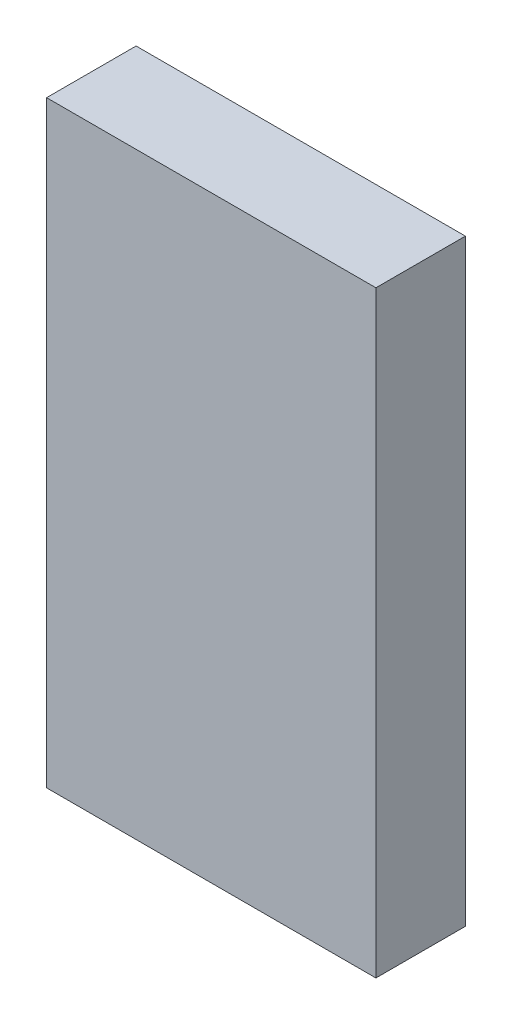
ISO-10303-21;
HEADER;
FILE_DESCRIPTION(('STEP AP214'),'2;1');
FILE_NAME('part.step','',(''),(''),'','','');
FILE_SCHEMA(('AUTOMOTIVE_DESIGN { 1 0 10303 214 1 1 1 1 }'));
ENDSEC;
DATA;
#1=APPLICATION_CONTEXT('core data for automotive mechanical design processes');
#2=APPLICATION_PROTOCOL_DEFINITION('international standard','automotive_design',2000,#1);
#3=PRODUCT_CONTEXT('',#1,'mechanical');
#4=PRODUCT('Part','Part','',(#3));
#5=PRODUCT_RELATED_PRODUCT_CATEGORY('part','',(#4));
#6=PRODUCT_DEFINITION_FORMATION('','',#4);
#7=PRODUCT_DEFINITION_CONTEXT('part definition',#1,'design');
#8=PRODUCT_DEFINITION('design','',#6,#7);
#9=PRODUCT_DEFINITION_SHAPE('','',#8);
#10=(LENGTH_UNIT() NAMED_UNIT(*) SI_UNIT(.MILLI.,.METRE.));
#11=(NAMED_UNIT(*) PLANE_ANGLE_UNIT() SI_UNIT($,.RADIAN.));
#12=(NAMED_UNIT(*) SI_UNIT($,.STERADIAN.) SOLID_ANGLE_UNIT());
#13=UNCERTAINTY_MEASURE_WITH_UNIT(LENGTH_MEASURE(1.E-05),#10,'distance_accuracy_value','');
#14=(GEOMETRIC_REPRESENTATION_CONTEXT(3) GLOBAL_UNCERTAINTY_ASSIGNED_CONTEXT((#13)) GLOBAL_UNIT_ASSIGNED_CONTEXT((#10,
#11,#12)) REPRESENTATION_CONTEXT('',''));
#15=CARTESIAN_POINT('',(0.,0.,0.));
#16=DIRECTION('',(0.,0.,1.));
#17=DIRECTION('',(1.,0.,0.));
#18=AXIS2_PLACEMENT_3D('',#15,#16,#17);
#19=CARTESIAN_POINT('',(-1.174,-1.439,0.));
#20=DIRECTION('',(1.,0.,0.));
#21=DIRECTION('',(0.,0.,1.));
#22=AXIS2_PLACEMENT_3D('',#19,#20,#21);
#23=PLANE('',#22);
#24=DIRECTION('',(0.,1.,0.));
#25=VECTOR('',#24,1.);
#26=CARTESIAN_POINT('',(-1.174,-1.439,0.1));
#27=LINE('',#26,#25);
#28=CARTESIAN_POINT('',(-1.174,-1.439,0.1));
#29=VERTEX_POINT('',#28);
#30=CARTESIAN_POINT('',(-1.174,-0.771,0.1));
#31=VERTEX_POINT('',#30);
#32=EDGE_CURVE('E11',#29,#31,#27,.T.);
#33=ORIENTED_EDGE('',*,*,#32,.T.);
#34=DIRECTION('',(0.,0.,1.));
#35=VECTOR('',#34,1.);
#36=CARTESIAN_POINT('',(-1.174,-0.771,0.));
#37=LINE('',#36,#35);
#38=CARTESIAN_POINT('',(-1.174,-0.771,0.));
#39=VERTEX_POINT('',#38);
#40=EDGE_CURVE('E24',#39,#31,#37,.T.);
#41=ORIENTED_EDGE('',*,*,#40,.F.);
#42=DIRECTION('',(0.,1.,0.));
#43=VECTOR('',#42,1.);
#44=CARTESIAN_POINT('',(-1.174,-1.439,0.));
#45=LINE('',#44,#43);
#46=CARTESIAN_POINT('',(-1.174,-1.439,0.));
#47=VERTEX_POINT('',#46);
#48=EDGE_CURVE('E86',#47,#39,#45,.T.);
#49=ORIENTED_EDGE('',*,*,#48,.F.);
#50=DIRECTION('',(0.,0.,1.));
#51=VECTOR('',#50,1.);
#52=CARTESIAN_POINT('',(-1.174,-1.439,0.));
#53=LINE('',#52,#51);
#54=EDGE_CURVE('E36',#47,#29,#53,.T.);
#55=ORIENTED_EDGE('',*,*,#54,.T.);
#56=EDGE_LOOP('',(#33,#41,#49,#55));
#57=FACE_BOUND('',#56,.T.);
#58=ADVANCED_FACE('F17',(#57),#23,.F.);
#59=CARTESIAN_POINT('',(-0.806,-1.439,0.));
#60=DIRECTION('',(1.,0.,0.));
#61=DIRECTION('',(0.,0.,1.));
#62=AXIS2_PLACEMENT_3D('',#59,#60,#61);
#63=PLANE('',#62);
#64=DIRECTION('',(0.,0.,1.));
#65=VECTOR('',#64,1.);
#66=CARTESIAN_POINT('',(-0.806,-1.439,0.));
#67=LINE('',#66,#65);
#68=CARTESIAN_POINT('',(-0.806,-1.439,0.));
#69=VERTEX_POINT('',#68);
#70=CARTESIAN_POINT('',(-0.806,-1.439,0.1));
#71=VERTEX_POINT('',#70);
#72=EDGE_CURVE('E83',#69,#71,#67,.T.);
#73=ORIENTED_EDGE('',*,*,#72,.F.);
#74=DIRECTION('',(0.,1.,0.));
#75=VECTOR('',#74,1.);
#76=CARTESIAN_POINT('',(-0.806,-1.439,0.));
#77=LINE('',#76,#75);
#78=CARTESIAN_POINT('',(-0.806,-0.771,0.));
#79=VERTEX_POINT('',#78);
#80=EDGE_CURVE('E63',#69,#79,#77,.T.);
#81=ORIENTED_EDGE('',*,*,#80,.T.);
#82=DIRECTION('',(0.,0.,1.));
#83=VECTOR('',#82,1.);
#84=CARTESIAN_POINT('',(-0.806,-0.771,0.));
#85=LINE('',#84,#83);
#86=CARTESIAN_POINT('',(-0.806,-0.771,0.1));
#87=VERTEX_POINT('',#86);
#88=EDGE_CURVE('E57',#79,#87,#85,.T.);
#89=ORIENTED_EDGE('',*,*,#88,.T.);
#90=DIRECTION('',(0.,1.,0.));
#91=VECTOR('',#90,1.);
#92=CARTESIAN_POINT('',(-0.806,-1.439,0.1));
#93=LINE('',#92,#91);
#94=EDGE_CURVE('E60',#71,#87,#93,.T.);
#95=ORIENTED_EDGE('',*,*,#94,.F.);
#96=EDGE_LOOP('',(#73,#81,#89,#95));
#97=FACE_BOUND('',#96,.T.);
#98=ADVANCED_FACE('F59',(#97),#63,.T.);
#99=CARTESIAN_POINT('',(-1.174,-1.439,0.));
#100=DIRECTION('',(0.,1.,0.));
#101=DIRECTION('',(0.,0.,1.));
#102=AXIS2_PLACEMENT_3D('',#99,#100,#101);
#103=PLANE('',#102);
#104=ORIENTED_EDGE('',*,*,#72,.T.);
#105=DIRECTION('',(1.,0.,0.));
#106=VECTOR('',#105,1.);
#107=CARTESIAN_POINT('',(-1.174,-1.439,0.1));
#108=LINE('',#107,#106);
#109=EDGE_CURVE('E71',#29,#71,#108,.T.);
#110=ORIENTED_EDGE('',*,*,#109,.F.);
#111=ORIENTED_EDGE('',*,*,#54,.F.);
#112=DIRECTION('',(1.,0.,0.));
#113=VECTOR('',#112,1.);
#114=CARTESIAN_POINT('',(-1.174,-1.439,0.));
#115=LINE('',#114,#113);
#116=EDGE_CURVE('E76',#47,#69,#115,.T.);
#117=ORIENTED_EDGE('',*,*,#116,.T.);
#118=EDGE_LOOP('',(#104,#110,#111,#117));
#119=FACE_BOUND('',#118,.T.);
#120=ADVANCED_FACE('F91',(#119),#103,.F.);
#121=CARTESIAN_POINT('',(-1.174,-0.771,0.));
#122=DIRECTION('',(0.,1.,0.));
#123=DIRECTION('',(0.,0.,1.));
#124=AXIS2_PLACEMENT_3D('',#121,#122,#123);
#125=PLANE('',#124);
#126=DIRECTION('',(1.,0.,0.));
#127=VECTOR('',#126,1.);
#128=CARTESIAN_POINT('',(-1.174,-0.771,0.));
#129=LINE('',#128,#127);
#130=EDGE_CURVE('E74',#39,#79,#129,.T.);
#131=ORIENTED_EDGE('',*,*,#130,.F.);
#132=ORIENTED_EDGE('',*,*,#40,.T.);
#133=DIRECTION('',(1.,0.,0.));
#134=VECTOR('',#133,1.);
#135=CARTESIAN_POINT('',(-1.174,-0.771,0.1));
#136=LINE('',#135,#134);
#137=EDGE_CURVE('E69',#31,#87,#136,.T.);
#138=ORIENTED_EDGE('',*,*,#137,.T.);
#139=ORIENTED_EDGE('',*,*,#88,.F.);
#140=EDGE_LOOP('',(#131,#132,#138,#139));
#141=FACE_BOUND('',#140,.T.);
#142=ADVANCED_FACE('F73',(#141),#125,.T.);
#143=CARTESIAN_POINT('',(-1.174,-1.439,0.));
#144=DIRECTION('',(0.,0.,1.));
#145=DIRECTION('',(1.,0.,0.));
#146=AXIS2_PLACEMENT_3D('',#143,#144,#145);
#147=PLANE('',#146);
#148=ORIENTED_EDGE('',*,*,#130,.T.);
#149=ORIENTED_EDGE('',*,*,#80,.F.);
#150=ORIENTED_EDGE('',*,*,#116,.F.);
#151=ORIENTED_EDGE('',*,*,#48,.T.);
#152=EDGE_LOOP('',(#148,#149,#150,#151));
#153=FACE_BOUND('',#152,.T.);
#154=ADVANCED_FACE('F89',(#153),#147,.F.);
#155=CARTESIAN_POINT('',(-1.174,-1.439,0.1));
#156=DIRECTION('',(0.,0.,1.));
#157=DIRECTION('',(1.,0.,0.));
#158=AXIS2_PLACEMENT_3D('',#155,#156,#157);
#159=PLANE('',#158);
#160=ORIENTED_EDGE('',*,*,#32,.F.);
#161=ORIENTED_EDGE('',*,*,#109,.T.);
#162=ORIENTED_EDGE('',*,*,#94,.T.);
#163=ORIENTED_EDGE('',*,*,#137,.F.);
#164=EDGE_LOOP('',(#160,#161,#162,#163));
#165=FACE_BOUND('',#164,.T.);
#166=ADVANCED_FACE('F68',(#165),#159,.T.);
#167=CLOSED_SHELL('',(#58,#98,#120,#142,#154,#166));
#168=MANIFOLD_SOLID_BREP('B1',#167);
#169=ADVANCED_BREP_SHAPE_REPRESENTATION('',(#18,#168),#14);
#170=SHAPE_DEFINITION_REPRESENTATION(#9,#169);
ENDSEC;
END-ISO-10303-21;
